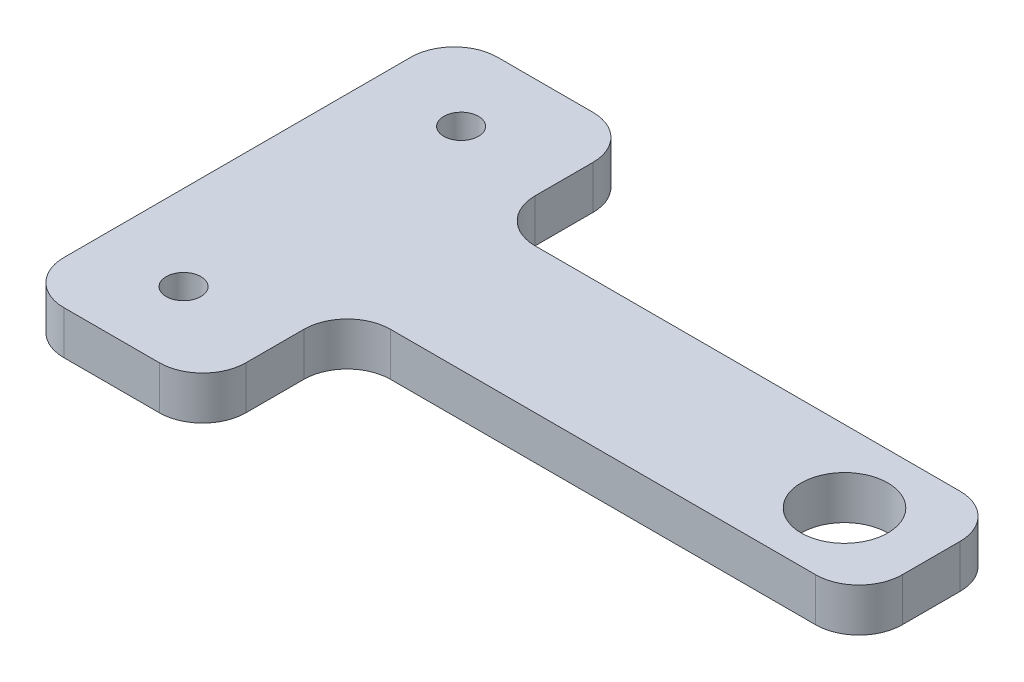
ISO-10303-21;
HEADER;
FILE_DESCRIPTION(('STEP AP214'),'2;1');
FILE_NAME('part.step','',(''),(''),'','','');
FILE_SCHEMA(('AUTOMOTIVE_DESIGN { 1 0 10303 214 1 1 1 1 }'));
ENDSEC;
DATA;
#1=APPLICATION_CONTEXT('core data for automotive mechanical design processes');
#2=APPLICATION_PROTOCOL_DEFINITION('international standard','automotive_design',2000,#1);
#3=PRODUCT_CONTEXT('',#1,'mechanical');
#4=PRODUCT('Part','Part','',(#3));
#5=PRODUCT_RELATED_PRODUCT_CATEGORY('part','',(#4));
#6=PRODUCT_DEFINITION_FORMATION('','',#4);
#7=PRODUCT_DEFINITION_CONTEXT('part definition',#1,'design');
#8=PRODUCT_DEFINITION('design','',#6,#7);
#9=PRODUCT_DEFINITION_SHAPE('','',#8);
#10=(LENGTH_UNIT() NAMED_UNIT(*) SI_UNIT(.MILLI.,.METRE.));
#11=(NAMED_UNIT(*) PLANE_ANGLE_UNIT() SI_UNIT($,.RADIAN.));
#12=(NAMED_UNIT(*) SI_UNIT($,.STERADIAN.) SOLID_ANGLE_UNIT());
#13=UNCERTAINTY_MEASURE_WITH_UNIT(LENGTH_MEASURE(1.E-05),#10,'distance_accuracy_value','');
#14=(GEOMETRIC_REPRESENTATION_CONTEXT(3) GLOBAL_UNCERTAINTY_ASSIGNED_CONTEXT((#13)) GLOBAL_UNIT_ASSIGNED_CONTEXT((#10,
#11,#12)) REPRESENTATION_CONTEXT('',''));
#15=CARTESIAN_POINT('',(0.,0.,0.));
#16=DIRECTION('',(0.,0.,1.));
#17=DIRECTION('',(1.,0.,0.));
#18=AXIS2_PLACEMENT_3D('',#15,#16,#17);
#19=CARTESIAN_POINT('',(40.,2.5,0.));
#20=DIRECTION('',(-1.,0.,0.));
#21=DIRECTION('',(0.,0.,1.));
#22=AXIS2_PLACEMENT_3D('',#19,#20,#21);
#23=PLANE('',#22);
#24=DIRECTION('',(0.,0.,-1.));
#25=VECTOR('',#24,1.);
#26=CARTESIAN_POINT('',(40.,0.,0.));
#27=LINE('',#26,#25);
#28=CARTESIAN_POINT('',(40.,0.,-10.8333333333333));
#29=VERTEX_POINT('',#28);
#30=CARTESIAN_POINT('',(40.,0.,-14.1666666666667));
#31=VERTEX_POINT('',#30);
#32=EDGE_CURVE('E179',#29,#31,#27,.T.);
#33=ORIENTED_EDGE('',*,*,#32,.T.);
#34=DIRECTION('',(0.,-1.,0.));
#35=VECTOR('',#34,1.);
#36=CARTESIAN_POINT('',(40.,2.5,-14.1666666666667));
#37=LINE('',#36,#35);
#38=CARTESIAN_POINT('',(40.,2.5,-14.1666666666667));
#39=VERTEX_POINT('',#38);
#40=EDGE_CURVE('E156',#31,#39,#37,.F.);
#41=ORIENTED_EDGE('',*,*,#40,.T.);
#42=DIRECTION('',(0.,0.,-1.));
#43=VECTOR('',#42,1.);
#44=CARTESIAN_POINT('',(40.,2.5,0.));
#45=LINE('',#44,#43);
#46=CARTESIAN_POINT('',(40.,2.5,-10.8333333333333));
#47=VERTEX_POINT('',#46);
#48=EDGE_CURVE('E343',#47,#39,#45,.T.);
#49=ORIENTED_EDGE('',*,*,#48,.F.);
#50=DIRECTION('',(0.,-1.,0.));
#51=VECTOR('',#50,1.);
#52=CARTESIAN_POINT('',(40.,0.,-10.8333333333333));
#53=LINE('',#52,#51);
#54=EDGE_CURVE('E161',#47,#29,#53,.T.);
#55=ORIENTED_EDGE('',*,*,#54,.T.);
#56=EDGE_LOOP('',(#33,#41,#49,#55));
#57=FACE_BOUND('',#56,.T.);
#58=ADVANCED_FACE('F37',(#57),#23,.F.);
#59=CARTESIAN_POINT('',(0.,2.5,-16.6666666666667));
#60=DIRECTION('',(0.,0.,1.));
#61=DIRECTION('',(1.,0.,0.));
#62=AXIS2_PLACEMENT_3D('',#59,#60,#61);
#63=PLANE('',#62);
#64=DIRECTION('',(-1.,0.,0.));
#65=VECTOR('',#64,1.);
#66=CARTESIAN_POINT('',(0.,2.5,-16.6666666666667));
#67=LINE('',#66,#65);
#68=CARTESIAN_POINT('',(37.5,2.5,-16.6666666666667));
#69=VERTEX_POINT('',#68);
#70=CARTESIAN_POINT('',(13.,2.5,-16.6666666666667));
#71=VERTEX_POINT('',#70);
#72=EDGE_CURVE('E171',#69,#71,#67,.T.);
#73=ORIENTED_EDGE('',*,*,#72,.F.);
#74=DIRECTION('',(0.,-1.,0.));
#75=VECTOR('',#74,1.);
#76=CARTESIAN_POINT('',(37.5,2.5,-16.6666666666667));
#77=LINE('',#76,#75);
#78=CARTESIAN_POINT('',(37.5,0.,-16.6666666666667));
#79=VERTEX_POINT('',#78);
#80=EDGE_CURVE('E155',#69,#79,#77,.T.);
#81=ORIENTED_EDGE('',*,*,#80,.T.);
#82=DIRECTION('',(-1.,0.,0.));
#83=VECTOR('',#82,1.);
#84=CARTESIAN_POINT('',(0.,0.,-16.6666666666667));
#85=LINE('',#84,#83);
#86=CARTESIAN_POINT('',(13.,0.,-16.6666666666667));
#87=VERTEX_POINT('',#86);
#88=EDGE_CURVE('E168',#79,#87,#85,.T.);
#89=ORIENTED_EDGE('',*,*,#88,.T.);
#90=DIRECTION('',(0.,-1.,0.));
#91=VECTOR('',#90,1.);
#92=CARTESIAN_POINT('',(13.,2.5,-16.6666666666667));
#93=LINE('',#92,#91);
#94=EDGE_CURVE('E173',#87,#71,#93,.F.);
#95=ORIENTED_EDGE('',*,*,#94,.T.);
#96=EDGE_LOOP('',(#73,#81,#89,#95));
#97=FACE_BOUND('',#96,.T.);
#98=ADVANCED_FACE('F167',(#97),#63,.F.);
#99=CARTESIAN_POINT('',(10.5,2.5,0.));
#100=DIRECTION('',(1.,0.,0.));
#101=DIRECTION('',(0.,0.,-1.));
#102=AXIS2_PLACEMENT_3D('',#99,#100,#101);
#103=PLANE('',#102);
#104=DIRECTION('',(0.,0.,1.));
#105=VECTOR('',#104,1.);
#106=CARTESIAN_POINT('',(10.5,2.5,0.));
#107=LINE('',#106,#105);
#108=CARTESIAN_POINT('',(10.5,2.5,-22.5));
#109=VERTEX_POINT('',#108);
#110=CARTESIAN_POINT('',(10.5,2.5,-19.1666666666667));
#111=VERTEX_POINT('',#110);
#112=EDGE_CURVE('E282',#109,#111,#107,.T.);
#113=ORIENTED_EDGE('',*,*,#112,.T.);
#114=DIRECTION('',(0.,-1.,0.));
#115=VECTOR('',#114,1.);
#116=CARTESIAN_POINT('',(10.5,2.5,-19.1666666666667));
#117=LINE('',#116,#115);
#118=CARTESIAN_POINT('',(10.5,0.,-19.1666666666667));
#119=VERTEX_POINT('',#118);
#120=EDGE_CURVE('E242',#111,#119,#117,.T.);
#121=ORIENTED_EDGE('',*,*,#120,.T.);
#122=DIRECTION('',(0.,0.,1.));
#123=VECTOR('',#122,1.);
#124=CARTESIAN_POINT('',(10.5,0.,0.));
#125=LINE('',#124,#123);
#126=CARTESIAN_POINT('',(10.5,0.,-22.5));
#127=VERTEX_POINT('',#126);
#128=EDGE_CURVE('E178',#127,#119,#125,.T.);
#129=ORIENTED_EDGE('',*,*,#128,.F.);
#130=DIRECTION('',(0.,-1.,0.));
#131=VECTOR('',#130,1.);
#132=CARTESIAN_POINT('',(10.5,2.5,-22.5));
#133=LINE('',#132,#131);
#134=EDGE_CURVE('E240',#127,#109,#133,.F.);
#135=ORIENTED_EDGE('',*,*,#134,.T.);
#136=EDGE_LOOP('',(#113,#121,#129,#135));
#137=FACE_BOUND('',#136,.T.);
#138=ADVANCED_FACE('F313',(#137),#103,.T.);
#139=CARTESIAN_POINT('',(0.,2.5,-25.));
#140=DIRECTION('',(0.,0.,-1.));
#141=DIRECTION('',(-1.,0.,0.));
#142=AXIS2_PLACEMENT_3D('',#139,#140,#141);
#143=PLANE('',#142);
#144=DIRECTION('',(1.,0.,0.));
#145=VECTOR('',#144,1.);
#146=CARTESIAN_POINT('',(0.,2.5,-25.));
#147=LINE('',#146,#145);
#148=CARTESIAN_POINT('',(2.5,2.5,-25.));
#149=VERTEX_POINT('',#148);
#150=CARTESIAN_POINT('',(8.,2.5,-25.));
#151=VERTEX_POINT('',#150);
#152=EDGE_CURVE('E357',#149,#151,#147,.T.);
#153=ORIENTED_EDGE('',*,*,#152,.T.);
#154=DIRECTION('',(0.,-1.,0.));
#155=VECTOR('',#154,1.);
#156=CARTESIAN_POINT('',(8.,2.5,-25.));
#157=LINE('',#156,#155);
#158=CARTESIAN_POINT('',(8.,0.,-25.));
#159=VERTEX_POINT('',#158);
#160=EDGE_CURVE('E247',#151,#159,#157,.T.);
#161=ORIENTED_EDGE('',*,*,#160,.T.);
#162=DIRECTION('',(1.,0.,0.));
#163=VECTOR('',#162,1.);
#164=CARTESIAN_POINT('',(0.,0.,-25.));
#165=LINE('',#164,#163);
#166=CARTESIAN_POINT('',(2.5,0.,-25.));
#167=VERTEX_POINT('',#166);
#168=EDGE_CURVE('E181',#167,#159,#165,.T.);
#169=ORIENTED_EDGE('',*,*,#168,.F.);
#170=DIRECTION('',(0.,-1.,0.));
#171=VECTOR('',#170,1.);
#172=CARTESIAN_POINT('',(2.5,2.5,-25.));
#173=LINE('',#172,#171);
#174=EDGE_CURVE('E245',#167,#149,#173,.F.);
#175=ORIENTED_EDGE('',*,*,#174,.T.);
#176=EDGE_LOOP('',(#153,#161,#169,#175));
#177=FACE_BOUND('',#176,.T.);
#178=ADVANCED_FACE('F316',(#177),#143,.T.);
#179=CARTESIAN_POINT('',(0.,2.5,0.));
#180=DIRECTION('',(-1.,0.,0.));
#181=DIRECTION('',(0.,0.,1.));
#182=AXIS2_PLACEMENT_3D('',#179,#180,#181);
#183=PLANE('',#182);
#184=DIRECTION('',(0.,0.,-1.));
#185=VECTOR('',#184,1.);
#186=CARTESIAN_POINT('',(0.,2.5,0.));
#187=LINE('',#186,#185);
#188=CARTESIAN_POINT('',(0.,2.5,-2.5));
#189=VERTEX_POINT('',#188);
#190=CARTESIAN_POINT('',(0.,2.5,-22.5));
#191=VERTEX_POINT('',#190);
#192=EDGE_CURVE('E359',#189,#191,#187,.T.);
#193=ORIENTED_EDGE('',*,*,#192,.T.);
#194=DIRECTION('',(0.,-1.,0.));
#195=VECTOR('',#194,1.);
#196=CARTESIAN_POINT('',(0.,2.5,-22.5));
#197=LINE('',#196,#195);
#198=CARTESIAN_POINT('',(0.,0.,-22.5));
#199=VERTEX_POINT('',#198);
#200=EDGE_CURVE('E252',#191,#199,#197,.T.);
#201=ORIENTED_EDGE('',*,*,#200,.T.);
#202=DIRECTION('',(0.,0.,-1.));
#203=VECTOR('',#202,1.);
#204=CARTESIAN_POINT('',(0.,0.,0.));
#205=LINE('',#204,#203);
#206=CARTESIAN_POINT('',(0.,0.,-2.5));
#207=VERTEX_POINT('',#206);
#208=EDGE_CURVE('E190',#207,#199,#205,.T.);
#209=ORIENTED_EDGE('',*,*,#208,.F.);
#210=DIRECTION('',(0.,-1.,0.));
#211=VECTOR('',#210,1.);
#212=CARTESIAN_POINT('',(0.,2.5,-2.5));
#213=LINE('',#212,#211);
#214=EDGE_CURVE('E250',#207,#189,#213,.F.);
#215=ORIENTED_EDGE('',*,*,#214,.T.);
#216=EDGE_LOOP('',(#193,#201,#209,#215));
#217=FACE_BOUND('',#216,.T.);
#218=ADVANCED_FACE('F319',(#217),#183,.T.);
#219=CARTESIAN_POINT('',(0.,2.5,0.));
#220=DIRECTION('',(0.,0.,-1.));
#221=DIRECTION('',(-1.,0.,0.));
#222=AXIS2_PLACEMENT_3D('',#219,#220,#221);
#223=PLANE('',#222);
#224=DIRECTION('',(1.,0.,0.));
#225=VECTOR('',#224,1.);
#226=CARTESIAN_POINT('',(0.,2.5,0.));
#227=LINE('',#226,#225);
#228=CARTESIAN_POINT('',(2.5,2.5,0.));
#229=VERTEX_POINT('',#228);
#230=CARTESIAN_POINT('',(8.00000000000001,2.5,0.));
#231=VERTEX_POINT('',#230);
#232=EDGE_CURVE('E280',#229,#231,#227,.T.);
#233=ORIENTED_EDGE('',*,*,#232,.F.);
#234=DIRECTION('',(0.,-1.,0.));
#235=VECTOR('',#234,1.);
#236=CARTESIAN_POINT('',(2.5,0.,0.));
#237=LINE('',#236,#235);
#238=CARTESIAN_POINT('',(2.5,0.,0.));
#239=VERTEX_POINT('',#238);
#240=EDGE_CURVE('E257',#229,#239,#237,.T.);
#241=ORIENTED_EDGE('',*,*,#240,.T.);
#242=DIRECTION('',(1.,0.,0.));
#243=VECTOR('',#242,1.);
#244=CARTESIAN_POINT('',(0.,0.,0.));
#245=LINE('',#244,#243);
#246=CARTESIAN_POINT('',(8.00000000000001,0.,0.));
#247=VERTEX_POINT('',#246);
#248=EDGE_CURVE('E193',#239,#247,#245,.T.);
#249=ORIENTED_EDGE('',*,*,#248,.T.);
#250=DIRECTION('',(0.,-1.,0.));
#251=VECTOR('',#250,1.);
#252=CARTESIAN_POINT('',(8.00000000000001,2.5,0.));
#253=LINE('',#252,#251);
#254=EDGE_CURVE('E255',#247,#231,#253,.F.);
#255=ORIENTED_EDGE('',*,*,#254,.T.);
#256=EDGE_LOOP('',(#233,#241,#249,#255));
#257=FACE_BOUND('',#256,.T.);
#258=ADVANCED_FACE('F323',(#257),#223,.F.);
#259=CARTESIAN_POINT('',(10.5,0.,-5.83333333333333));
#260=VERTEX_POINT('',#259);
#261=CARTESIAN_POINT('',(10.5,0.,-2.5));
#262=VERTEX_POINT('',#261);
#263=EDGE_CURVE('E183',#260,#262,#125,.T.);
#264=ORIENTED_EDGE('',*,*,#263,.F.);
#265=DIRECTION('',(0.,-1.,0.));
#266=VECTOR('',#265,1.);
#267=CARTESIAN_POINT('',(10.5,2.5,-5.83333333333333));
#268=LINE('',#267,#266);
#269=CARTESIAN_POINT('',(10.5,2.5,-5.83333333333333));
#270=VERTEX_POINT('',#269);
#271=EDGE_CURVE('E238',#260,#270,#268,.F.);
#272=ORIENTED_EDGE('',*,*,#271,.T.);
#273=CARTESIAN_POINT('',(10.5,2.5,-2.5));
#274=VERTEX_POINT('',#273);
#275=EDGE_CURVE('E276',#270,#274,#107,.T.);
#276=ORIENTED_EDGE('',*,*,#275,.T.);
#277=DIRECTION('',(0.,-1.,0.));
#278=VECTOR('',#277,1.);
#279=CARTESIAN_POINT('',(10.5,0.,-2.5));
#280=LINE('',#279,#278);
#281=EDGE_CURVE('E235',#274,#262,#280,.T.);
#282=ORIENTED_EDGE('',*,*,#281,.T.);
#283=EDGE_LOOP('',(#264,#272,#276,#282));
#284=FACE_BOUND('',#283,.T.);
#285=ADVANCED_FACE('F268',(#284),#103,.T.);
#286=CARTESIAN_POINT('',(4.9,2.5,-4.5));
#287=DIRECTION('',(0.,-1.,0.));
#288=DIRECTION('',(0.,0.,-1.));
#289=AXIS2_PLACEMENT_3D('',#286,#287,#288);
#290=CYLINDRICAL_SURFACE('',#289,1.);
#291=CARTESIAN_POINT('',(4.9,2.5,-4.5));
#292=DIRECTION('',(0.,1.,0.));
#293=DIRECTION('',(0.,0.,1.));
#294=AXIS2_PLACEMENT_3D('',#291,#292,#293);
#295=CIRCLE('',#294,1.);
#296=CARTESIAN_POINT('',(4.9,2.5,-3.5));
#297=VERTEX_POINT('',#296);
#298=EDGE_CURVE('E275',#297,#297,#295,.T.);
#299=ORIENTED_EDGE('',*,*,#298,.T.);
#300=EDGE_LOOP('',(#299));
#301=FACE_BOUND('',#300,.T.);
#302=CARTESIAN_POINT('',(4.9,0.,-4.5));
#303=DIRECTION('',(0.,1.,0.));
#304=DIRECTION('',(0.,0.,1.));
#305=AXIS2_PLACEMENT_3D('',#302,#303,#304);
#306=CIRCLE('',#305,1.);
#307=CARTESIAN_POINT('',(4.9,0.,-3.5));
#308=VERTEX_POINT('',#307);
#309=EDGE_CURVE('E199',#308,#308,#306,.T.);
#310=ORIENTED_EDGE('',*,*,#309,.F.);
#311=EDGE_LOOP('',(#310));
#312=FACE_BOUND('',#311,.T.);
#313=ADVANCED_FACE('F303',(#301,#312),#290,.F.);
#314=CARTESIAN_POINT('',(0.,2.5,-8.33333333333333));
#315=DIRECTION('',(0.,0.,1.));
#316=DIRECTION('',(1.,0.,0.));
#317=AXIS2_PLACEMENT_3D('',#314,#315,#316);
#318=PLANE('',#317);
#319=DIRECTION('',(-1.,0.,0.));
#320=VECTOR('',#319,1.);
#321=CARTESIAN_POINT('',(0.,0.,-8.33333333333333));
#322=LINE('',#321,#320);
#323=CARTESIAN_POINT('',(37.5,0.,-8.33333333333333));
#324=VERTEX_POINT('',#323);
#325=CARTESIAN_POINT('',(13.,0.,-8.33333333333333));
#326=VERTEX_POINT('',#325);
#327=EDGE_CURVE('E196',#324,#326,#322,.T.);
#328=ORIENTED_EDGE('',*,*,#327,.F.);
#329=DIRECTION('',(0.,-1.,0.));
#330=VECTOR('',#329,1.);
#331=CARTESIAN_POINT('',(37.5,2.5,-8.33333333333333));
#332=LINE('',#331,#330);
#333=CARTESIAN_POINT('',(37.5,2.5,-8.33333333333333));
#334=VERTEX_POINT('',#333);
#335=EDGE_CURVE('E59',#324,#334,#332,.F.);
#336=ORIENTED_EDGE('',*,*,#335,.T.);
#337=DIRECTION('',(-1.,0.,0.));
#338=VECTOR('',#337,1.);
#339=CARTESIAN_POINT('',(0.,2.5,-8.33333333333333));
#340=LINE('',#339,#338);
#341=CARTESIAN_POINT('',(13.,2.5,-8.33333333333333));
#342=VERTEX_POINT('',#341);
#343=EDGE_CURVE('E273',#334,#342,#340,.T.);
#344=ORIENTED_EDGE('',*,*,#343,.T.);
#345=DIRECTION('',(0.,-1.,0.));
#346=VECTOR('',#345,1.);
#347=CARTESIAN_POINT('',(13.,0.,-8.33333333333333));
#348=LINE('',#347,#346);
#349=EDGE_CURVE('E231',#342,#326,#348,.T.);
#350=ORIENTED_EDGE('',*,*,#349,.T.);
#351=EDGE_LOOP('',(#328,#336,#344,#350));
#352=FACE_BOUND('',#351,.T.);
#353=ADVANCED_FACE('F272',(#352),#318,.T.);
#354=CARTESIAN_POINT('',(35.,2.5,-12.5));
#355=DIRECTION('',(0.,-1.,0.));
#356=DIRECTION('',(0.,0.,-1.));
#357=AXIS2_PLACEMENT_3D('',#354,#355,#356);
#358=CYLINDRICAL_SURFACE('',#357,2.5);
#359=CARTESIAN_POINT('',(35.,2.5,-12.5));
#360=DIRECTION('',(0.,1.,0.));
#361=DIRECTION('',(0.,0.,1.));
#362=AXIS2_PLACEMENT_3D('',#359,#360,#361);
#363=CIRCLE('',#362,2.5);
#364=CARTESIAN_POINT('',(35.,2.5,-10.));
#365=VERTEX_POINT('',#364);
#366=EDGE_CURVE('E205',#365,#365,#363,.T.);
#367=ORIENTED_EDGE('',*,*,#366,.T.);
#368=EDGE_LOOP('',(#367));
#369=FACE_BOUND('',#368,.T.);
#370=CARTESIAN_POINT('',(35.,0.,-12.5));
#371=DIRECTION('',(0.,1.,0.));
#372=DIRECTION('',(0.,0.,1.));
#373=AXIS2_PLACEMENT_3D('',#370,#371,#372);
#374=CIRCLE('',#373,2.5);
#375=CARTESIAN_POINT('',(35.,0.,-10.));
#376=VERTEX_POINT('',#375);
#377=EDGE_CURVE('E184',#376,#376,#374,.T.);
#378=ORIENTED_EDGE('',*,*,#377,.F.);
#379=EDGE_LOOP('',(#378));
#380=FACE_BOUND('',#379,.T.);
#381=ADVANCED_FACE('F291',(#369,#380),#358,.F.);
#382=CARTESIAN_POINT('',(4.9,2.5,-20.5));
#383=DIRECTION('',(0.,-1.,0.));
#384=DIRECTION('',(0.,0.,-1.));
#385=AXIS2_PLACEMENT_3D('',#382,#383,#384);
#386=CYLINDRICAL_SURFACE('',#385,1.);
#387=CARTESIAN_POINT('',(4.9,2.5,-20.5));
#388=DIRECTION('',(0.,1.,0.));
#389=DIRECTION('',(0.,0.,1.));
#390=AXIS2_PLACEMENT_3D('',#387,#388,#389);
#391=CIRCLE('',#390,1.);
#392=CARTESIAN_POINT('',(4.9,2.5,-19.5));
#393=VERTEX_POINT('',#392);
#394=EDGE_CURVE('E206',#393,#393,#391,.T.);
#395=ORIENTED_EDGE('',*,*,#394,.T.);
#396=EDGE_LOOP('',(#395));
#397=FACE_BOUND('',#396,.T.);
#398=CARTESIAN_POINT('',(4.9,0.,-20.5));
#399=DIRECTION('',(0.,1.,0.));
#400=DIRECTION('',(0.,0.,1.));
#401=AXIS2_PLACEMENT_3D('',#398,#399,#400);
#402=CIRCLE('',#401,1.);
#403=CARTESIAN_POINT('',(4.9,0.,-19.5));
#404=VERTEX_POINT('',#403);
#405=EDGE_CURVE('E202',#404,#404,#402,.T.);
#406=ORIENTED_EDGE('',*,*,#405,.F.);
#407=EDGE_LOOP('',(#406));
#408=FACE_BOUND('',#407,.T.);
#409=ADVANCED_FACE('F293',(#397,#408),#386,.F.);
#410=CARTESIAN_POINT('',(0.,2.5,0.));
#411=DIRECTION('',(0.,1.,0.));
#412=DIRECTION('',(0.,0.,1.));
#413=AXIS2_PLACEMENT_3D('',#410,#411,#412);
#414=PLANE('',#413);
#415=ORIENTED_EDGE('',*,*,#366,.F.);
#416=EDGE_LOOP('',(#415));
#417=FACE_BOUND('',#416,.T.);
#418=ORIENTED_EDGE('',*,*,#48,.T.);
#419=CARTESIAN_POINT('',(37.5,2.5,-14.1666666666667));
#420=DIRECTION('',(0.,1.,0.));
#421=DIRECTION('',(0.,0.,1.));
#422=AXIS2_PLACEMENT_3D('',#419,#420,#421);
#423=CIRCLE('',#422,2.5);
#424=EDGE_CURVE('E229',#39,#69,#423,.T.);
#425=ORIENTED_EDGE('',*,*,#424,.T.);
#426=ORIENTED_EDGE('',*,*,#72,.T.);
#427=CARTESIAN_POINT('',(13.,2.5,-19.1666666666667));
#428=DIRECTION('',(0.,1.,0.));
#429=DIRECTION('',(0.,0.,1.));
#430=AXIS2_PLACEMENT_3D('',#427,#428,#429);
#431=CIRCLE('',#430,2.5);
#432=EDGE_CURVE('E11',#71,#111,#431,.F.);
#433=ORIENTED_EDGE('',*,*,#432,.T.);
#434=ORIENTED_EDGE('',*,*,#112,.F.);
#435=CARTESIAN_POINT('',(8.,2.5,-22.5));
#436=DIRECTION('',(0.,1.,0.));
#437=DIRECTION('',(0.,0.,1.));
#438=AXIS2_PLACEMENT_3D('',#435,#436,#437);
#439=CIRCLE('',#438,2.5);
#440=EDGE_CURVE('E225',#109,#151,#439,.T.);
#441=ORIENTED_EDGE('',*,*,#440,.T.);
#442=ORIENTED_EDGE('',*,*,#152,.F.);
#443=CARTESIAN_POINT('',(2.5,2.5,-22.5));
#444=DIRECTION('',(0.,1.,0.));
#445=DIRECTION('',(0.,0.,1.));
#446=AXIS2_PLACEMENT_3D('',#443,#444,#445);
#447=CIRCLE('',#446,2.5);
#448=EDGE_CURVE('E223',#149,#191,#447,.T.);
#449=ORIENTED_EDGE('',*,*,#448,.T.);
#450=ORIENTED_EDGE('',*,*,#192,.F.);
#451=CARTESIAN_POINT('',(2.5,2.5,-2.5));
#452=DIRECTION('',(0.,1.,0.));
#453=DIRECTION('',(0.,0.,1.));
#454=AXIS2_PLACEMENT_3D('',#451,#452,#453);
#455=CIRCLE('',#454,2.5);
#456=EDGE_CURVE('E221',#189,#229,#455,.T.);
#457=ORIENTED_EDGE('',*,*,#456,.T.);
#458=ORIENTED_EDGE('',*,*,#232,.T.);
#459=CARTESIAN_POINT('',(8.00000000000001,2.5,-2.5));
#460=DIRECTION('',(0.,1.,0.));
#461=DIRECTION('',(0.,0.,1.));
#462=AXIS2_PLACEMENT_3D('',#459,#460,#461);
#463=CIRCLE('',#462,2.5);
#464=EDGE_CURVE('E219',#231,#274,#463,.T.);
#465=ORIENTED_EDGE('',*,*,#464,.T.);
#466=ORIENTED_EDGE('',*,*,#275,.F.);
#467=CARTESIAN_POINT('',(13.,2.5,-5.83333333333333));
#468=DIRECTION('',(0.,1.,0.));
#469=DIRECTION('',(0.,0.,1.));
#470=AXIS2_PLACEMENT_3D('',#467,#468,#469);
#471=CIRCLE('',#470,2.5);
#472=EDGE_CURVE('E52',#270,#342,#471,.F.);
#473=ORIENTED_EDGE('',*,*,#472,.T.);
#474=ORIENTED_EDGE('',*,*,#343,.F.);
#475=CARTESIAN_POINT('',(37.5,2.5,-10.8333333333333));
#476=DIRECTION('',(0.,1.,0.));
#477=DIRECTION('',(0.,0.,1.));
#478=AXIS2_PLACEMENT_3D('',#475,#476,#477);
#479=CIRCLE('',#478,2.5);
#480=EDGE_CURVE('E227',#334,#47,#479,.T.);
#481=ORIENTED_EDGE('',*,*,#480,.T.);
#482=EDGE_LOOP('',(#418,#425,#426,#433,#434,#441,#442,#449,#450,#457,#458,#465,#466,#473,#474,#481));
#483=FACE_BOUND('',#482,.T.);
#484=ORIENTED_EDGE('',*,*,#298,.F.);
#485=EDGE_LOOP('',(#484));
#486=FACE_BOUND('',#485,.T.);
#487=ORIENTED_EDGE('',*,*,#394,.F.);
#488=EDGE_LOOP('',(#487));
#489=FACE_BOUND('',#488,.T.);
#490=ADVANCED_FACE('F300',(#417,#483,#486,#489),#414,.T.);
#491=CARTESIAN_POINT('',(0.,0.,0.));
#492=DIRECTION('',(0.,1.,0.));
#493=DIRECTION('',(0.,0.,1.));
#494=AXIS2_PLACEMENT_3D('',#491,#492,#493);
#495=PLANE('',#494);
#496=ORIENTED_EDGE('',*,*,#377,.T.);
#497=EDGE_LOOP('',(#496));
#498=FACE_BOUND('',#497,.T.);
#499=ORIENTED_EDGE('',*,*,#88,.F.);
#500=CARTESIAN_POINT('',(37.5,0.,-14.1666666666667));
#501=DIRECTION('',(0.,1.,0.));
#502=DIRECTION('',(0.,0.,1.));
#503=AXIS2_PLACEMENT_3D('',#500,#501,#502);
#504=CIRCLE('',#503,2.5);
#505=EDGE_CURVE('E151',#79,#31,#504,.F.);
#506=ORIENTED_EDGE('',*,*,#505,.T.);
#507=ORIENTED_EDGE('',*,*,#32,.F.);
#508=CARTESIAN_POINT('',(37.5,0.,-10.8333333333333));
#509=DIRECTION('',(0.,1.,0.));
#510=DIRECTION('',(0.,0.,1.));
#511=AXIS2_PLACEMENT_3D('',#508,#509,#510);
#512=CIRCLE('',#511,2.5);
#513=EDGE_CURVE('E162',#29,#324,#512,.F.);
#514=ORIENTED_EDGE('',*,*,#513,.T.);
#515=ORIENTED_EDGE('',*,*,#327,.T.);
#516=CARTESIAN_POINT('',(13.,0.,-5.83333333333333));
#517=DIRECTION('',(0.,1.,0.));
#518=DIRECTION('',(0.,0.,1.));
#519=AXIS2_PLACEMENT_3D('',#516,#517,#518);
#520=CIRCLE('',#519,2.5);
#521=EDGE_CURVE('E260',#326,#260,#520,.T.);
#522=ORIENTED_EDGE('',*,*,#521,.T.);
#523=ORIENTED_EDGE('',*,*,#263,.T.);
#524=CARTESIAN_POINT('',(8.00000000000001,0.,-2.5));
#525=DIRECTION('',(0.,1.,0.));
#526=DIRECTION('',(0.,0.,1.));
#527=AXIS2_PLACEMENT_3D('',#524,#525,#526);
#528=CIRCLE('',#527,2.5);
#529=EDGE_CURVE('E172',#262,#247,#528,.F.);
#530=ORIENTED_EDGE('',*,*,#529,.T.);
#531=ORIENTED_EDGE('',*,*,#248,.F.);
#532=CARTESIAN_POINT('',(2.5,0.,-2.5));
#533=DIRECTION('',(0.,1.,0.));
#534=DIRECTION('',(0.,0.,1.));
#535=AXIS2_PLACEMENT_3D('',#532,#533,#534);
#536=CIRCLE('',#535,2.5);
#537=EDGE_CURVE('E209',#239,#207,#536,.F.);
#538=ORIENTED_EDGE('',*,*,#537,.T.);
#539=ORIENTED_EDGE('',*,*,#208,.T.);
#540=CARTESIAN_POINT('',(2.5,0.,-22.5));
#541=DIRECTION('',(0.,1.,0.));
#542=DIRECTION('',(0.,0.,1.));
#543=AXIS2_PLACEMENT_3D('',#540,#541,#542);
#544=CIRCLE('',#543,2.5);
#545=EDGE_CURVE('E211',#199,#167,#544,.F.);
#546=ORIENTED_EDGE('',*,*,#545,.T.);
#547=ORIENTED_EDGE('',*,*,#168,.T.);
#548=CARTESIAN_POINT('',(8.,0.,-22.5));
#549=DIRECTION('',(0.,1.,0.));
#550=DIRECTION('',(0.,0.,1.));
#551=AXIS2_PLACEMENT_3D('',#548,#549,#550);
#552=CIRCLE('',#551,2.5);
#553=EDGE_CURVE('E213',#159,#127,#552,.F.);
#554=ORIENTED_EDGE('',*,*,#553,.T.);
#555=ORIENTED_EDGE('',*,*,#128,.T.);
#556=CARTESIAN_POINT('',(13.,0.,-19.1666666666667));
#557=DIRECTION('',(0.,1.,0.));
#558=DIRECTION('',(0.,0.,1.));
#559=AXIS2_PLACEMENT_3D('',#556,#557,#558);
#560=CIRCLE('',#559,2.5);
#561=EDGE_CURVE('E45',#119,#87,#560,.T.);
#562=ORIENTED_EDGE('',*,*,#561,.T.);
#563=EDGE_LOOP('',(#499,#506,#507,#514,#515,#522,#523,#530,#531,#538,#539,#546,#547,#554,#555,#562));
#564=FACE_BOUND('',#563,.T.);
#565=ORIENTED_EDGE('',*,*,#309,.T.);
#566=EDGE_LOOP('',(#565));
#567=FACE_BOUND('',#566,.T.);
#568=ORIENTED_EDGE('',*,*,#405,.T.);
#569=EDGE_LOOP('',(#568));
#570=FACE_BOUND('',#569,.T.);
#571=ADVANCED_FACE('F175',(#498,#564,#567,#570),#495,.F.);
#572=CARTESIAN_POINT('',(37.5,2.5,-14.1666666666667));
#573=DIRECTION('',(0.,-1.,0.));
#574=DIRECTION('',(0.,0.,-1.));
#575=AXIS2_PLACEMENT_3D('',#572,#573,#574);
#576=CYLINDRICAL_SURFACE('',#575,2.5);
#577=ORIENTED_EDGE('',*,*,#424,.F.);
#578=ORIENTED_EDGE('',*,*,#40,.F.);
#579=ORIENTED_EDGE('',*,*,#505,.F.);
#580=ORIENTED_EDGE('',*,*,#80,.F.);
#581=EDGE_LOOP('',(#577,#578,#579,#580));
#582=FACE_BOUND('',#581,.T.);
#583=ADVANCED_FACE('F154',(#582),#576,.T.);
#584=CARTESIAN_POINT('',(37.5,2.5,-10.8333333333333));
#585=DIRECTION('',(0.,1.,0.));
#586=DIRECTION('',(0.,0.,1.));
#587=AXIS2_PLACEMENT_3D('',#584,#585,#586);
#588=CYLINDRICAL_SURFACE('',#587,2.5);
#589=ORIENTED_EDGE('',*,*,#480,.F.);
#590=ORIENTED_EDGE('',*,*,#335,.F.);
#591=ORIENTED_EDGE('',*,*,#513,.F.);
#592=ORIENTED_EDGE('',*,*,#54,.F.);
#593=EDGE_LOOP('',(#589,#590,#591,#592));
#594=FACE_BOUND('',#593,.T.);
#595=ADVANCED_FACE('F401',(#594),#588,.T.);
#596=CARTESIAN_POINT('',(13.,2.5,-5.83333333333333));
#597=DIRECTION('',(0.,1.,0.));
#598=DIRECTION('',(0.,0.,1.));
#599=AXIS2_PLACEMENT_3D('',#596,#597,#598);
#600=CYLINDRICAL_SURFACE('',#599,2.5);
#601=ORIENTED_EDGE('',*,*,#472,.F.);
#602=ORIENTED_EDGE('',*,*,#271,.F.);
#603=ORIENTED_EDGE('',*,*,#521,.F.);
#604=ORIENTED_EDGE('',*,*,#349,.F.);
#605=EDGE_LOOP('',(#601,#602,#603,#604));
#606=FACE_BOUND('',#605,.T.);
#607=ADVANCED_FACE('F271',(#606),#600,.F.);
#608=CARTESIAN_POINT('',(13.,2.5,-19.1666666666667));
#609=DIRECTION('',(0.,-1.,0.));
#610=DIRECTION('',(0.,0.,-1.));
#611=AXIS2_PLACEMENT_3D('',#608,#609,#610);
#612=CYLINDRICAL_SURFACE('',#611,2.5);
#613=ORIENTED_EDGE('',*,*,#432,.F.);
#614=ORIENTED_EDGE('',*,*,#94,.F.);
#615=ORIENTED_EDGE('',*,*,#561,.F.);
#616=ORIENTED_EDGE('',*,*,#120,.F.);
#617=EDGE_LOOP('',(#613,#614,#615,#616));
#618=FACE_BOUND('',#617,.T.);
#619=ADVANCED_FACE('F393',(#618),#612,.F.);
#620=CARTESIAN_POINT('',(8.,2.5,-22.5));
#621=DIRECTION('',(0.,-1.,0.));
#622=DIRECTION('',(0.,0.,-1.));
#623=AXIS2_PLACEMENT_3D('',#620,#621,#622);
#624=CYLINDRICAL_SURFACE('',#623,2.5);
#625=ORIENTED_EDGE('',*,*,#440,.F.);
#626=ORIENTED_EDGE('',*,*,#134,.F.);
#627=ORIENTED_EDGE('',*,*,#553,.F.);
#628=ORIENTED_EDGE('',*,*,#160,.F.);
#629=EDGE_LOOP('',(#625,#626,#627,#628));
#630=FACE_BOUND('',#629,.T.);
#631=ADVANCED_FACE('F384',(#630),#624,.T.);
#632=CARTESIAN_POINT('',(2.5,2.5,-22.5));
#633=DIRECTION('',(0.,-1.,0.));
#634=DIRECTION('',(0.,0.,-1.));
#635=AXIS2_PLACEMENT_3D('',#632,#633,#634);
#636=CYLINDRICAL_SURFACE('',#635,2.5);
#637=ORIENTED_EDGE('',*,*,#448,.F.);
#638=ORIENTED_EDGE('',*,*,#174,.F.);
#639=ORIENTED_EDGE('',*,*,#545,.F.);
#640=ORIENTED_EDGE('',*,*,#200,.F.);
#641=EDGE_LOOP('',(#637,#638,#639,#640));
#642=FACE_BOUND('',#641,.T.);
#643=ADVANCED_FACE('F377',(#642),#636,.T.);
#644=CARTESIAN_POINT('',(2.5,2.5,-2.5));
#645=DIRECTION('',(0.,1.,0.));
#646=DIRECTION('',(0.,0.,1.));
#647=AXIS2_PLACEMENT_3D('',#644,#645,#646);
#648=CYLINDRICAL_SURFACE('',#647,2.5);
#649=ORIENTED_EDGE('',*,*,#456,.F.);
#650=ORIENTED_EDGE('',*,*,#214,.F.);
#651=ORIENTED_EDGE('',*,*,#537,.F.);
#652=ORIENTED_EDGE('',*,*,#240,.F.);
#653=EDGE_LOOP('',(#649,#650,#651,#652));
#654=FACE_BOUND('',#653,.T.);
#655=ADVANCED_FACE('F372',(#654),#648,.T.);
#656=CARTESIAN_POINT('',(8.00000000000001,2.5,-2.5));
#657=DIRECTION('',(0.,1.,0.));
#658=DIRECTION('',(0.,0.,1.));
#659=AXIS2_PLACEMENT_3D('',#656,#657,#658);
#660=CYLINDRICAL_SURFACE('',#659,2.5);
#661=ORIENTED_EDGE('',*,*,#464,.F.);
#662=ORIENTED_EDGE('',*,*,#254,.F.);
#663=ORIENTED_EDGE('',*,*,#529,.F.);
#664=ORIENTED_EDGE('',*,*,#281,.F.);
#665=EDGE_LOOP('',(#661,#662,#663,#664));
#666=FACE_BOUND('',#665,.T.);
#667=ADVANCED_FACE('F39',(#666),#660,.T.);
#668=CLOSED_SHELL('',(#58,#98,#138,#178,#218,#258,#285,#313,#353,#381,#409,#490,#571,#583,#595,
#607,#619,#631,#643,#655,#667));
#669=MANIFOLD_SOLID_BREP('B2',#668);
#670=ADVANCED_BREP_SHAPE_REPRESENTATION('',(#18,#669),#14);
#671=SHAPE_DEFINITION_REPRESENTATION(#9,#670);
ENDSEC;
END-ISO-10303-21;
